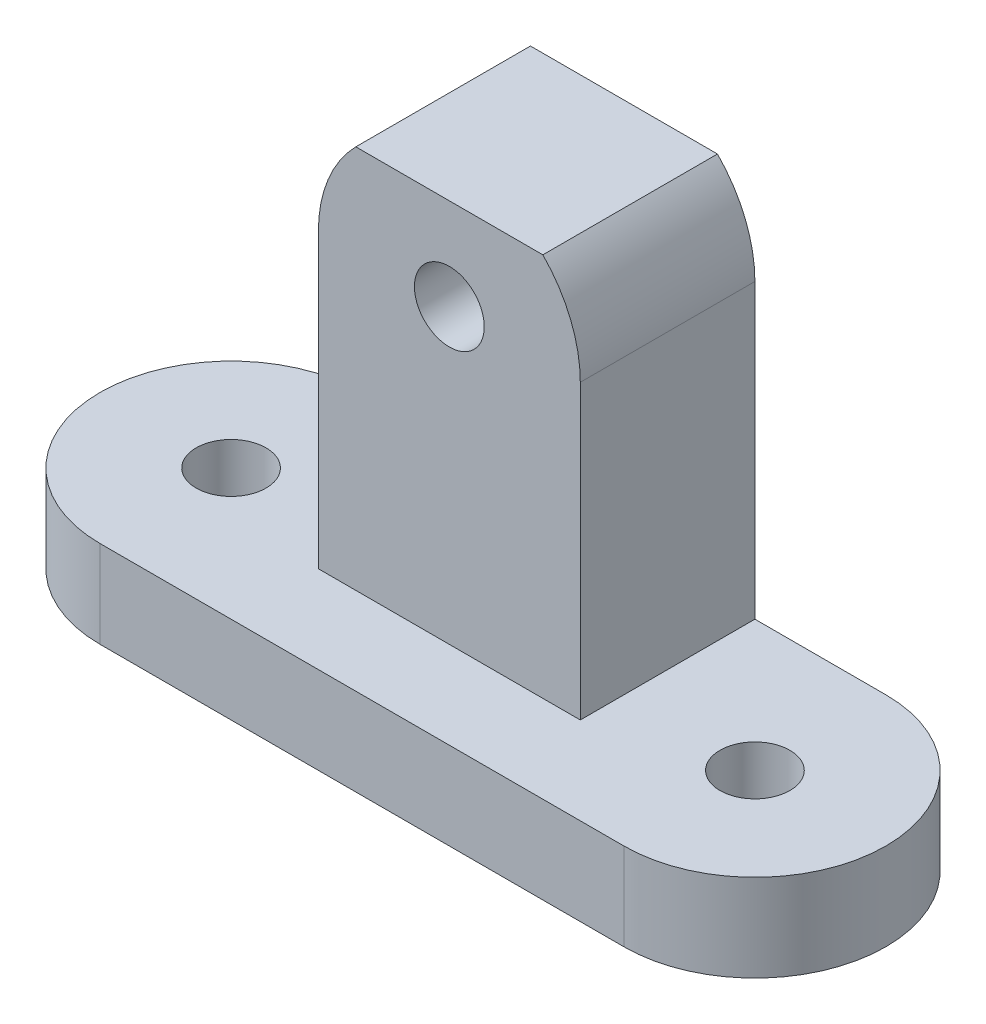
ISO-10303-21;
HEADER;
FILE_DESCRIPTION(('STEP AP214'),'2;1');
FILE_NAME('part.step','',(''),(''),'','','');
FILE_SCHEMA(('AUTOMOTIVE_DESIGN { 1 0 10303 214 1 1 1 1 }'));
ENDSEC;
DATA;
#1=APPLICATION_CONTEXT('core data for automotive mechanical design processes');
#2=APPLICATION_PROTOCOL_DEFINITION('international standard','automotive_design',2000,#1);
#3=PRODUCT_CONTEXT('',#1,'mechanical');
#4=PRODUCT('Part','Part','',(#3));
#5=PRODUCT_RELATED_PRODUCT_CATEGORY('part','',(#4));
#6=PRODUCT_DEFINITION_FORMATION('','',#4);
#7=PRODUCT_DEFINITION_CONTEXT('part definition',#1,'design');
#8=PRODUCT_DEFINITION('design','',#6,#7);
#9=PRODUCT_DEFINITION_SHAPE('','',#8);
#10=(LENGTH_UNIT() NAMED_UNIT(*) SI_UNIT(.MILLI.,.METRE.));
#11=(NAMED_UNIT(*) PLANE_ANGLE_UNIT() SI_UNIT($,.RADIAN.));
#12=(NAMED_UNIT(*) SI_UNIT($,.STERADIAN.) SOLID_ANGLE_UNIT());
#13=UNCERTAINTY_MEASURE_WITH_UNIT(LENGTH_MEASURE(1.E-05),#10,'distance_accuracy_value','');
#14=(GEOMETRIC_REPRESENTATION_CONTEXT(3) GLOBAL_UNCERTAINTY_ASSIGNED_CONTEXT((#13)) GLOBAL_UNIT_ASSIGNED_CONTEXT((#10,
#11,#12)) REPRESENTATION_CONTEXT('',''));
#15=CARTESIAN_POINT('',(0.,0.,0.));
#16=DIRECTION('',(0.,0.,1.));
#17=DIRECTION('',(1.,0.,0.));
#18=AXIS2_PLACEMENT_3D('',#15,#16,#17);
#19=CARTESIAN_POINT('',(15.,21.75,-5.));
#20=DIRECTION('',(0.,0.,-1.));
#21=DIRECTION('',(-1.,0.,0.));
#22=AXIS2_PLACEMENT_3D('',#19,#20,#21);
#23=CYLINDRICAL_SURFACE('',#22,7.5);
#24=DIRECTION('',(0.,0.,-1.));
#25=VECTOR('',#24,1.);
#26=CARTESIAN_POINT('',(9.64392867859285,27.,-5.));
#27=LINE('',#26,#25);
#28=CARTESIAN_POINT('',(9.64392867859285,27.,-15.));
#29=VERTEX_POINT('',#28);
#30=CARTESIAN_POINT('',(9.64392867859285,27.,-5.));
#31=VERTEX_POINT('',#30);
#32=EDGE_CURVE('E48',#29,#31,#27,.F.);
#33=ORIENTED_EDGE('',*,*,#32,.F.);
#34=CARTESIAN_POINT('',(15.,21.75,-15.));
#35=DIRECTION('',(0.,0.,-1.));
#36=DIRECTION('',(1.,0.,0.));
#37=AXIS2_PLACEMENT_3D('',#34,#35,#36);
#38=CIRCLE('',#37,7.5);
#39=CARTESIAN_POINT('',(7.5,21.75,-15.));
#40=VERTEX_POINT('',#39);
#41=EDGE_CURVE('E124',#40,#29,#38,.T.);
#42=ORIENTED_EDGE('',*,*,#41,.F.);
#43=DIRECTION('',(0.,0.,-1.));
#44=VECTOR('',#43,1.);
#45=CARTESIAN_POINT('',(7.5,21.75,-5.));
#46=LINE('',#45,#44);
#47=CARTESIAN_POINT('',(7.5,21.75,-5.));
#48=VERTEX_POINT('',#47);
#49=EDGE_CURVE('E138',#48,#40,#46,.T.);
#50=ORIENTED_EDGE('',*,*,#49,.F.);
#51=CARTESIAN_POINT('',(15.,21.75,-5.));
#52=DIRECTION('',(0.,0.,-1.));
#53=DIRECTION('',(1.,0.,0.));
#54=AXIS2_PLACEMENT_3D('',#51,#52,#53);
#55=CIRCLE('',#54,7.5);
#56=EDGE_CURVE('E144',#48,#31,#55,.T.);
#57=ORIENTED_EDGE('',*,*,#56,.T.);
#58=EDGE_LOOP('',(#33,#42,#50,#57));
#59=FACE_BOUND('',#58,.T.);
#60=ADVANCED_FACE('F34',(#59),#23,.T.);
#61=CARTESIAN_POINT('',(0.,5.,-7.5));
#62=DIRECTION('',(0.,1.,0.));
#63=DIRECTION('',(0.,0.,1.));
#64=AXIS2_PLACEMENT_3D('',#61,#62,#63);
#65=PLANE('',#64);
#66=DIRECTION('',(0.,0.,-1.));
#67=VECTOR('',#66,1.);
#68=CARTESIAN_POINT('',(22.5,5.,-5.));
#69=LINE('',#68,#67);
#70=CARTESIAN_POINT('',(22.5,5.,-5.));
#71=VERTEX_POINT('',#70);
#72=CARTESIAN_POINT('',(22.5,5.,-15.));
#73=VERTEX_POINT('',#72);
#74=EDGE_CURVE('E142',#71,#73,#69,.T.);
#75=ORIENTED_EDGE('',*,*,#74,.F.);
#76=DIRECTION('',(-1.,0.,0.));
#77=VECTOR('',#76,1.);
#78=CARTESIAN_POINT('',(22.5,5.,-5.));
#79=LINE('',#78,#77);
#80=CARTESIAN_POINT('',(7.49999999999999,5.,-5.));
#81=VERTEX_POINT('',#80);
#82=EDGE_CURVE('E223',#71,#81,#79,.T.);
#83=ORIENTED_EDGE('',*,*,#82,.T.);
#84=DIRECTION('',(0.,0.,-1.));
#85=VECTOR('',#84,1.);
#86=CARTESIAN_POINT('',(7.49999999999999,5.,-5.));
#87=LINE('',#86,#85);
#88=CARTESIAN_POINT('',(7.49999999999999,5.,-15.));
#89=VERTEX_POINT('',#88);
#90=EDGE_CURVE('E140',#81,#89,#87,.T.);
#91=ORIENTED_EDGE('',*,*,#90,.T.);
#92=DIRECTION('',(-1.,0.,0.));
#93=VECTOR('',#92,1.);
#94=CARTESIAN_POINT('',(0.,5.,-15.));
#95=LINE('',#94,#93);
#96=CARTESIAN_POINT('',(0.,5.,-15.));
#97=VERTEX_POINT('',#96);
#98=EDGE_CURVE('E165',#89,#97,#95,.T.);
#99=ORIENTED_EDGE('',*,*,#98,.T.);
#100=CARTESIAN_POINT('',(0.,5.,-7.5));
#101=DIRECTION('',(0.,1.,0.));
#102=DIRECTION('',(0.,0.,1.));
#103=AXIS2_PLACEMENT_3D('',#100,#101,#102);
#104=CIRCLE('',#103,7.5);
#105=CARTESIAN_POINT('',(0.,5.,0.));
#106=VERTEX_POINT('',#105);
#107=EDGE_CURVE('E157',#97,#106,#104,.T.);
#108=ORIENTED_EDGE('',*,*,#107,.T.);
#109=DIRECTION('',(1.,0.,0.));
#110=VECTOR('',#109,1.);
#111=CARTESIAN_POINT('',(0.,5.,0.));
#112=LINE('',#111,#110);
#113=CARTESIAN_POINT('',(30.,5.,0.));
#114=VERTEX_POINT('',#113);
#115=EDGE_CURVE('E160',#106,#114,#112,.T.);
#116=ORIENTED_EDGE('',*,*,#115,.T.);
#117=CARTESIAN_POINT('',(30.,5.,-7.50000000000001));
#118=DIRECTION('',(0.,1.,0.));
#119=DIRECTION('',(0.,0.,-1.));
#120=AXIS2_PLACEMENT_3D('',#117,#118,#119);
#121=CIRCLE('',#120,7.50000000000001);
#122=CARTESIAN_POINT('',(30.,5.,-15.));
#123=VERTEX_POINT('',#122);
#124=EDGE_CURVE('E163',#114,#123,#121,.T.);
#125=ORIENTED_EDGE('',*,*,#124,.T.);
#126=EDGE_CURVE('E166',#123,#73,#95,.T.);
#127=ORIENTED_EDGE('',*,*,#126,.T.);
#128=EDGE_LOOP('',(#75,#83,#91,#99,#108,#116,#125,#127));
#129=FACE_BOUND('',#128,.T.);
#130=CARTESIAN_POINT('',(0.,5.,-7.5));
#131=DIRECTION('',(0.,1.,0.));
#132=DIRECTION('',(0.,0.,1.));
#133=AXIS2_PLACEMENT_3D('',#130,#131,#132);
#134=CIRCLE('',#133,2.);
#135=CARTESIAN_POINT('',(0.,5.,-5.5));
#136=VERTEX_POINT('',#135);
#137=EDGE_CURVE('E151',#136,#136,#134,.T.);
#138=ORIENTED_EDGE('',*,*,#137,.F.);
#139=EDGE_LOOP('',(#138));
#140=FACE_BOUND('',#139,.T.);
#141=CARTESIAN_POINT('',(30.,5.,-7.50000000000001));
#142=DIRECTION('',(0.,1.,0.));
#143=DIRECTION('',(0.,0.,1.));
#144=AXIS2_PLACEMENT_3D('',#141,#142,#143);
#145=CIRCLE('',#144,2.);
#146=CARTESIAN_POINT('',(30.,5.,-5.5));
#147=VERTEX_POINT('',#146);
#148=EDGE_CURVE('E145',#147,#147,#145,.T.);
#149=ORIENTED_EDGE('',*,*,#148,.F.);
#150=EDGE_LOOP('',(#149));
#151=FACE_BOUND('',#150,.T.);
#152=ADVANCED_FACE('F205',(#129,#140,#151),#65,.T.);
#153=CARTESIAN_POINT('',(0.,0.,-7.5));
#154=DIRECTION('',(0.,1.,0.));
#155=DIRECTION('',(0.,0.,1.));
#156=AXIS2_PLACEMENT_3D('',#153,#154,#155);
#157=PLANE('',#156);
#158=CARTESIAN_POINT('',(0.,0.,-7.5));
#159=DIRECTION('',(0.,1.,0.));
#160=DIRECTION('',(0.,0.,1.));
#161=AXIS2_PLACEMENT_3D('',#158,#159,#160);
#162=CIRCLE('',#161,7.5);
#163=CARTESIAN_POINT('',(0.,0.,-15.));
#164=VERTEX_POINT('',#163);
#165=CARTESIAN_POINT('',(0.,0.,0.));
#166=VERTEX_POINT('',#165);
#167=EDGE_CURVE('E154',#164,#166,#162,.T.);
#168=ORIENTED_EDGE('',*,*,#167,.F.);
#169=DIRECTION('',(-1.,0.,0.));
#170=VECTOR('',#169,1.);
#171=CARTESIAN_POINT('',(0.,0.,-15.));
#172=LINE('',#171,#170);
#173=CARTESIAN_POINT('',(30.,0.,-15.));
#174=VERTEX_POINT('',#173);
#175=EDGE_CURVE('E161',#174,#164,#172,.T.);
#176=ORIENTED_EDGE('',*,*,#175,.F.);
#177=CARTESIAN_POINT('',(30.,0.,-7.50000000000001));
#178=DIRECTION('',(0.,1.,0.));
#179=DIRECTION('',(0.,0.,-1.));
#180=AXIS2_PLACEMENT_3D('',#177,#178,#179);
#181=CIRCLE('',#180,7.50000000000001);
#182=CARTESIAN_POINT('',(30.,0.,0.));
#183=VERTEX_POINT('',#182);
#184=EDGE_CURVE('E174',#183,#174,#181,.T.);
#185=ORIENTED_EDGE('',*,*,#184,.F.);
#186=DIRECTION('',(1.,0.,0.));
#187=VECTOR('',#186,1.);
#188=CARTESIAN_POINT('',(0.,0.,0.));
#189=LINE('',#188,#187);
#190=EDGE_CURVE('E172',#166,#183,#189,.T.);
#191=ORIENTED_EDGE('',*,*,#190,.F.);
#192=EDGE_LOOP('',(#168,#176,#185,#191));
#193=FACE_BOUND('',#192,.T.);
#194=CARTESIAN_POINT('',(0.,0.,-7.5));
#195=DIRECTION('',(0.,1.,0.));
#196=DIRECTION('',(0.,0.,1.));
#197=AXIS2_PLACEMENT_3D('',#194,#195,#196);
#198=CIRCLE('',#197,2.);
#199=CARTESIAN_POINT('',(0.,0.,-5.5));
#200=VERTEX_POINT('',#199);
#201=EDGE_CURVE('E148',#200,#200,#198,.T.);
#202=ORIENTED_EDGE('',*,*,#201,.T.);
#203=EDGE_LOOP('',(#202));
#204=FACE_BOUND('',#203,.T.);
#205=CARTESIAN_POINT('',(30.,0.,-7.50000000000001));
#206=DIRECTION('',(0.,1.,0.));
#207=DIRECTION('',(0.,0.,1.));
#208=AXIS2_PLACEMENT_3D('',#205,#206,#207);
#209=CIRCLE('',#208,2.);
#210=CARTESIAN_POINT('',(30.,0.,-5.5));
#211=VERTEX_POINT('',#210);
#212=EDGE_CURVE('E137',#211,#211,#209,.T.);
#213=ORIENTED_EDGE('',*,*,#212,.T.);
#214=EDGE_LOOP('',(#213));
#215=FACE_BOUND('',#214,.T.);
#216=ADVANCED_FACE('F195',(#193,#204,#215),#157,.F.);
#217=CARTESIAN_POINT('',(0.,5.,-7.5));
#218=DIRECTION('',(0.,-1.,0.));
#219=DIRECTION('',(0.,0.,-1.));
#220=AXIS2_PLACEMENT_3D('',#217,#218,#219);
#221=CYLINDRICAL_SURFACE('',#220,7.5);
#222=ORIENTED_EDGE('',*,*,#167,.T.);
#223=DIRECTION('',(0.,-1.,0.));
#224=VECTOR('',#223,1.);
#225=CARTESIAN_POINT('',(0.,5.,0.));
#226=LINE('',#225,#224);
#227=EDGE_CURVE('E42',#106,#166,#226,.T.);
#228=ORIENTED_EDGE('',*,*,#227,.F.);
#229=ORIENTED_EDGE('',*,*,#107,.F.);
#230=DIRECTION('',(0.,-1.,0.));
#231=VECTOR('',#230,1.);
#232=CARTESIAN_POINT('',(0.,5.,-15.));
#233=LINE('',#232,#231);
#234=EDGE_CURVE('E169',#97,#164,#233,.T.);
#235=ORIENTED_EDGE('',*,*,#234,.T.);
#236=EDGE_LOOP('',(#222,#228,#229,#235));
#237=FACE_BOUND('',#236,.T.);
#238=ADVANCED_FACE('F36',(#237),#221,.T.);
#239=CARTESIAN_POINT('',(0.,5.,0.));
#240=DIRECTION('',(0.,0.,-1.));
#241=DIRECTION('',(-1.,0.,0.));
#242=AXIS2_PLACEMENT_3D('',#239,#240,#241);
#243=PLANE('',#242);
#244=ORIENTED_EDGE('',*,*,#190,.T.);
#245=DIRECTION('',(0.,-1.,0.));
#246=VECTOR('',#245,1.);
#247=CARTESIAN_POINT('',(30.,5.,0.));
#248=LINE('',#247,#246);
#249=EDGE_CURVE('E182',#114,#183,#248,.T.);
#250=ORIENTED_EDGE('',*,*,#249,.F.);
#251=ORIENTED_EDGE('',*,*,#115,.F.);
#252=ORIENTED_EDGE('',*,*,#227,.T.);
#253=EDGE_LOOP('',(#244,#250,#251,#252));
#254=FACE_BOUND('',#253,.T.);
#255=ADVANCED_FACE('F187',(#254),#243,.F.);
#256=CARTESIAN_POINT('',(30.,5.,-7.50000000000001));
#257=DIRECTION('',(0.,-1.,0.));
#258=DIRECTION('',(0.,0.,-1.));
#259=AXIS2_PLACEMENT_3D('',#256,#257,#258);
#260=CYLINDRICAL_SURFACE('',#259,7.50000000000001);
#261=ORIENTED_EDGE('',*,*,#184,.T.);
#262=DIRECTION('',(0.,-1.,0.));
#263=VECTOR('',#262,1.);
#264=CARTESIAN_POINT('',(30.,5.,-15.));
#265=LINE('',#264,#263);
#266=EDGE_CURVE('E179',#123,#174,#265,.T.);
#267=ORIENTED_EDGE('',*,*,#266,.F.);
#268=ORIENTED_EDGE('',*,*,#124,.F.);
#269=ORIENTED_EDGE('',*,*,#249,.T.);
#270=EDGE_LOOP('',(#261,#267,#268,#269));
#271=FACE_BOUND('',#270,.T.);
#272=ADVANCED_FACE('F200',(#271),#260,.T.);
#273=CARTESIAN_POINT('',(0.,5.,-15.));
#274=DIRECTION('',(0.,0.,1.));
#275=DIRECTION('',(1.,0.,0.));
#276=AXIS2_PLACEMENT_3D('',#273,#274,#275);
#277=PLANE('',#276);
#278=ORIENTED_EDGE('',*,*,#41,.T.);
#279=DIRECTION('',(-1.,0.,0.));
#280=VECTOR('',#279,1.);
#281=CARTESIAN_POINT('',(25.4970257052633,27.,-15.));
#282=LINE('',#281,#280);
#283=CARTESIAN_POINT('',(20.3560713214071,27.,-15.));
#284=VERTEX_POINT('',#283);
#285=EDGE_CURVE('E111',#284,#29,#282,.T.);
#286=ORIENTED_EDGE('',*,*,#285,.F.);
#287=CARTESIAN_POINT('',(22.5,21.75,-15.));
#288=VERTEX_POINT('',#287);
#289=EDGE_CURVE('E121',#284,#288,#38,.T.);
#290=ORIENTED_EDGE('',*,*,#289,.T.);
#291=DIRECTION('',(0.,-1.,0.));
#292=VECTOR('',#291,1.);
#293=CARTESIAN_POINT('',(22.5,5.,-15.));
#294=LINE('',#293,#292);
#295=EDGE_CURVE('E132',#288,#73,#294,.T.);
#296=ORIENTED_EDGE('',*,*,#295,.T.);
#297=ORIENTED_EDGE('',*,*,#126,.F.);
#298=ORIENTED_EDGE('',*,*,#266,.T.);
#299=ORIENTED_EDGE('',*,*,#175,.T.);
#300=ORIENTED_EDGE('',*,*,#234,.F.);
#301=ORIENTED_EDGE('',*,*,#98,.F.);
#302=DIRECTION('',(0.,1.,0.));
#303=VECTOR('',#302,1.);
#304=CARTESIAN_POINT('',(7.49999999999999,5.,-15.));
#305=LINE('',#304,#303);
#306=EDGE_CURVE('E56',#89,#40,#305,.T.);
#307=ORIENTED_EDGE('',*,*,#306,.T.);
#308=EDGE_LOOP('',(#278,#286,#290,#296,#297,#298,#299,#300,#301,#307));
#309=FACE_BOUND('',#308,.T.);
#310=CARTESIAN_POINT('',(15.,21.75,-15.));
#311=DIRECTION('',(0.,0.,-1.));
#312=DIRECTION('',(-1.,0.,0.));
#313=AXIS2_PLACEMENT_3D('',#310,#311,#312);
#314=CIRCLE('',#313,2.00000000000001);
#315=CARTESIAN_POINT('',(13.,21.75,-15.));
#316=VERTEX_POINT('',#315);
#317=EDGE_CURVE('E213',#316,#316,#314,.T.);
#318=ORIENTED_EDGE('',*,*,#317,.F.);
#319=EDGE_LOOP('',(#318));
#320=FACE_BOUND('',#319,.T.);
#321=ADVANCED_FACE('F118',(#309,#320),#277,.F.);
#322=CARTESIAN_POINT('',(0.,5.,-7.5));
#323=DIRECTION('',(0.,-1.,0.));
#324=DIRECTION('',(0.,0.,-1.));
#325=AXIS2_PLACEMENT_3D('',#322,#323,#324);
#326=CYLINDRICAL_SURFACE('',#325,2.);
#327=ORIENTED_EDGE('',*,*,#137,.T.);
#328=EDGE_LOOP('',(#327));
#329=FACE_BOUND('',#328,.T.);
#330=ORIENTED_EDGE('',*,*,#201,.F.);
#331=EDGE_LOOP('',(#330));
#332=FACE_BOUND('',#331,.T.);
#333=ADVANCED_FACE('F283',(#329,#332),#326,.F.);
#334=CARTESIAN_POINT('',(30.,5.,-7.50000000000001));
#335=DIRECTION('',(0.,-1.,0.));
#336=DIRECTION('',(0.,0.,-1.));
#337=AXIS2_PLACEMENT_3D('',#334,#335,#336);
#338=CYLINDRICAL_SURFACE('',#337,2.);
#339=ORIENTED_EDGE('',*,*,#148,.T.);
#340=EDGE_LOOP('',(#339));
#341=FACE_BOUND('',#340,.T.);
#342=ORIENTED_EDGE('',*,*,#212,.F.);
#343=EDGE_LOOP('',(#342));
#344=FACE_BOUND('',#343,.T.);
#345=ADVANCED_FACE('F306',(#341,#344),#338,.F.);
#346=CARTESIAN_POINT('',(22.5,5.,-5.));
#347=DIRECTION('',(1.,0.,0.));
#348=DIRECTION('',(0.,0.,-1.));
#349=AXIS2_PLACEMENT_3D('',#346,#347,#348);
#350=PLANE('',#349);
#351=ORIENTED_EDGE('',*,*,#295,.F.);
#352=DIRECTION('',(0.,0.,-1.));
#353=VECTOR('',#352,1.);
#354=CARTESIAN_POINT('',(22.5,21.75,-5.));
#355=LINE('',#354,#353);
#356=CARTESIAN_POINT('',(22.5,21.75,-5.));
#357=VERTEX_POINT('',#356);
#358=EDGE_CURVE('E128',#357,#288,#355,.T.);
#359=ORIENTED_EDGE('',*,*,#358,.F.);
#360=DIRECTION('',(0.,-1.,0.));
#361=VECTOR('',#360,1.);
#362=CARTESIAN_POINT('',(22.5,5.,-5.));
#363=LINE('',#362,#361);
#364=EDGE_CURVE('E131',#357,#71,#363,.T.);
#365=ORIENTED_EDGE('',*,*,#364,.T.);
#366=ORIENTED_EDGE('',*,*,#74,.T.);
#367=EDGE_LOOP('',(#351,#359,#365,#366));
#368=FACE_BOUND('',#367,.T.);
#369=ADVANCED_FACE('F231',(#368),#350,.T.);
#370=DIRECTION('',(0.,0.,-1.));
#371=VECTOR('',#370,1.);
#372=CARTESIAN_POINT('',(20.3560713214071,27.,-5.));
#373=LINE('',#372,#371);
#374=CARTESIAN_POINT('',(20.3560713214071,27.,-5.));
#375=VERTEX_POINT('',#374);
#376=EDGE_CURVE('E108',#375,#284,#373,.T.);
#377=ORIENTED_EDGE('',*,*,#376,.F.);
#378=EDGE_CURVE('E227',#375,#357,#55,.T.);
#379=ORIENTED_EDGE('',*,*,#378,.T.);
#380=ORIENTED_EDGE('',*,*,#358,.T.);
#381=ORIENTED_EDGE('',*,*,#289,.F.);
#382=EDGE_LOOP('',(#377,#379,#380,#381));
#383=FACE_BOUND('',#382,.T.);
#384=ADVANCED_FACE('F126',(#383),#23,.T.);
#385=CARTESIAN_POINT('',(7.49999999999999,5.,-5.));
#386=DIRECTION('',(-1.,0.,0.));
#387=DIRECTION('',(0.,-1.,0.));
#388=AXIS2_PLACEMENT_3D('',#385,#386,#387);
#389=PLANE('',#388);
#390=ORIENTED_EDGE('',*,*,#306,.F.);
#391=ORIENTED_EDGE('',*,*,#90,.F.);
#392=DIRECTION('',(0.,1.,0.));
#393=VECTOR('',#392,1.);
#394=CARTESIAN_POINT('',(7.49999999999999,5.,-5.));
#395=LINE('',#394,#393);
#396=EDGE_CURVE('E225',#81,#48,#395,.T.);
#397=ORIENTED_EDGE('',*,*,#396,.T.);
#398=ORIENTED_EDGE('',*,*,#49,.T.);
#399=EDGE_LOOP('',(#390,#391,#397,#398));
#400=FACE_BOUND('',#399,.T.);
#401=ADVANCED_FACE('F235',(#400),#389,.T.);
#402=CARTESIAN_POINT('',(15.,21.75,-5.));
#403=DIRECTION('',(0.,0.,1.));
#404=DIRECTION('',(1.,0.,0.));
#405=AXIS2_PLACEMENT_3D('',#402,#403,#404);
#406=PLANE('',#405);
#407=DIRECTION('',(1.,0.,0.));
#408=VECTOR('',#407,1.);
#409=CARTESIAN_POINT('',(15.,27.,-5.));
#410=LINE('',#409,#408);
#411=EDGE_CURVE('E11',#31,#375,#410,.T.);
#412=ORIENTED_EDGE('',*,*,#411,.F.);
#413=ORIENTED_EDGE('',*,*,#56,.F.);
#414=ORIENTED_EDGE('',*,*,#396,.F.);
#415=ORIENTED_EDGE('',*,*,#82,.F.);
#416=ORIENTED_EDGE('',*,*,#364,.F.);
#417=ORIENTED_EDGE('',*,*,#378,.F.);
#418=EDGE_LOOP('',(#412,#413,#414,#415,#416,#417));
#419=FACE_BOUND('',#418,.T.);
#420=CARTESIAN_POINT('',(15.,21.75,-5.));
#421=DIRECTION('',(0.,0.,-1.));
#422=DIRECTION('',(-1.,0.,0.));
#423=AXIS2_PLACEMENT_3D('',#420,#421,#422);
#424=CIRCLE('',#423,2.00000000000001);
#425=CARTESIAN_POINT('',(13.,21.75,-5.));
#426=VERTEX_POINT('',#425);
#427=EDGE_CURVE('E216',#426,#426,#424,.T.);
#428=ORIENTED_EDGE('',*,*,#427,.T.);
#429=EDGE_LOOP('',(#428));
#430=FACE_BOUND('',#429,.T.);
#431=ADVANCED_FACE('F232',(#419,#430),#406,.T.);
#432=CARTESIAN_POINT('',(15.,21.75,-5.));
#433=DIRECTION('',(0.,0.,-1.));
#434=DIRECTION('',(-1.,0.,0.));
#435=AXIS2_PLACEMENT_3D('',#432,#433,#434);
#436=CYLINDRICAL_SURFACE('',#435,2.00000000000001);
#437=ORIENTED_EDGE('',*,*,#427,.F.);
#438=EDGE_LOOP('',(#437));
#439=FACE_BOUND('',#438,.T.);
#440=ORIENTED_EDGE('',*,*,#317,.T.);
#441=EDGE_LOOP('',(#440));
#442=FACE_BOUND('',#441,.T.);
#443=ADVANCED_FACE('F242',(#439,#442),#436,.F.);
#444=CARTESIAN_POINT('',(25.4970257052634,27.,0.));
#445=DIRECTION('',(0.,-1.,0.));
#446=DIRECTION('',(0.,0.,-1.));
#447=AXIS2_PLACEMENT_3D('',#444,#445,#446);
#448=PLANE('',#447);
#449=ORIENTED_EDGE('',*,*,#32,.T.);
#450=ORIENTED_EDGE('',*,*,#411,.T.);
#451=ORIENTED_EDGE('',*,*,#376,.T.);
#452=ORIENTED_EDGE('',*,*,#285,.T.);
#453=EDGE_LOOP('',(#449,#450,#451,#452));
#454=FACE_BOUND('',#453,.T.);
#455=ADVANCED_FACE('F110',(#454),#448,.F.);
#456=CLOSED_SHELL('',(#60,#152,#216,#238,#255,#272,#321,#333,#345,#369,#384,#401,#431,#443,#455));
#457=MANIFOLD_SOLID_BREP('B2',#456);
#458=ADVANCED_BREP_SHAPE_REPRESENTATION('',(#18,#457),#14);
#459=SHAPE_DEFINITION_REPRESENTATION(#9,#458);
ENDSEC;
END-ISO-10303-21;
